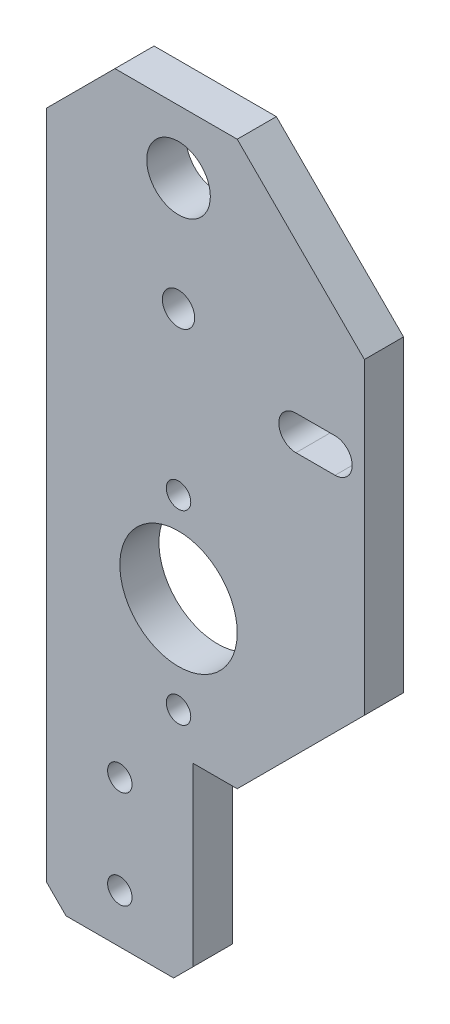
ISO-10303-21;
HEADER;
FILE_DESCRIPTION(('STEP AP214'),'2;1');
FILE_NAME('part.step','',(''),(''),'','','');
FILE_SCHEMA(('AUTOMOTIVE_DESIGN { 1 0 10303 214 1 1 1 1 }'));
ENDSEC;
DATA;
#1=APPLICATION_CONTEXT('core data for automotive mechanical design processes');
#2=APPLICATION_PROTOCOL_DEFINITION('international standard','automotive_design',2000,#1);
#3=PRODUCT_CONTEXT('',#1,'mechanical');
#4=PRODUCT('Part','Part','',(#3));
#5=PRODUCT_RELATED_PRODUCT_CATEGORY('part','',(#4));
#6=PRODUCT_DEFINITION_FORMATION('','',#4);
#7=PRODUCT_DEFINITION_CONTEXT('part definition',#1,'design');
#8=PRODUCT_DEFINITION('design','',#6,#7);
#9=PRODUCT_DEFINITION_SHAPE('','',#8);
#10=(LENGTH_UNIT() NAMED_UNIT(*) SI_UNIT(.MILLI.,.METRE.));
#11=(NAMED_UNIT(*) PLANE_ANGLE_UNIT() SI_UNIT($,.RADIAN.));
#12=(NAMED_UNIT(*) SI_UNIT($,.STERADIAN.) SOLID_ANGLE_UNIT());
#13=UNCERTAINTY_MEASURE_WITH_UNIT(LENGTH_MEASURE(1.E-05),#10,'distance_accuracy_value','');
#14=(GEOMETRIC_REPRESENTATION_CONTEXT(3) GLOBAL_UNCERTAINTY_ASSIGNED_CONTEXT((#13)) GLOBAL_UNIT_ASSIGNED_CONTEXT((#10,
#11,#12)) REPRESENTATION_CONTEXT('',''));
#15=CARTESIAN_POINT('',(0.,0.,0.));
#16=DIRECTION('',(0.,0.,1.));
#17=DIRECTION('',(1.,0.,0.));
#18=AXIS2_PLACEMENT_3D('',#15,#16,#17);
#19=CARTESIAN_POINT('',(0.,0.,4.));
#20=DIRECTION('',(0.,0.,1.));
#21=DIRECTION('',(1.,0.,0.));
#22=AXIS2_PLACEMENT_3D('',#19,#20,#21);
#23=PLANE('',#22);
#24=CARTESIAN_POINT('',(-8.63157894736842,-1.39473684210528,4.));
#25=DIRECTION('',(0.,0.,1.));
#26=DIRECTION('',(1.,0.,0.));
#27=AXIS2_PLACEMENT_3D('',#24,#25,#26);
#28=CIRCLE('',#27,1.25);
#29=CARTESIAN_POINT('',(-7.38157894736842,-1.39473684210528,4.));
#30=VERTEX_POINT('',#29);
#31=EDGE_CURVE('E397',#30,#30,#28,.T.);
#32=ORIENTED_EDGE('',*,*,#31,.F.);
#33=EDGE_LOOP('',(#32));
#34=FACE_BOUND('',#33,.T.);
#35=CARTESIAN_POINT('',(-8.63157894736842,-20.3947368421053,4.));
#36=DIRECTION('',(0.,0.,1.));
#37=DIRECTION('',(1.,0.,0.));
#38=AXIS2_PLACEMENT_3D('',#35,#36,#37);
#39=CIRCLE('',#38,1.25);
#40=CARTESIAN_POINT('',(-7.38157894736842,-20.3947368421053,4.));
#41=VERTEX_POINT('',#40);
#42=EDGE_CURVE('E401',#41,#41,#39,.T.);
#43=ORIENTED_EDGE('',*,*,#42,.F.);
#44=EDGE_LOOP('',(#43));
#45=FACE_BOUND('',#44,.T.);
#46=CARTESIAN_POINT('',(-14.6315789473684,-29.3947368421053,4.));
#47=DIRECTION('',(0.,0.,1.));
#48=DIRECTION('',(1.,0.,0.));
#49=AXIS2_PLACEMENT_3D('',#46,#47,#48);
#50=CIRCLE('',#49,1.25);
#51=CARTESIAN_POINT('',(-13.3815789473684,-29.3947368421053,4.));
#52=VERTEX_POINT('',#51);
#53=EDGE_CURVE('E407',#52,#52,#50,.T.);
#54=ORIENTED_EDGE('',*,*,#53,.F.);
#55=EDGE_LOOP('',(#54));
#56=FACE_BOUND('',#55,.T.);
#57=CARTESIAN_POINT('',(-14.6315789473684,-39.3947368421053,4.));
#58=DIRECTION('',(0.,0.,1.));
#59=DIRECTION('',(1.,0.,0.));
#60=AXIS2_PLACEMENT_3D('',#57,#58,#59);
#61=CIRCLE('',#60,1.25);
#62=CARTESIAN_POINT('',(-13.3815789473684,-39.3947368421053,4.));
#63=VERTEX_POINT('',#62);
#64=EDGE_CURVE('E413',#63,#63,#61,.T.);
#65=ORIENTED_EDGE('',*,*,#64,.F.);
#66=EDGE_LOOP('',(#65));
#67=FACE_BOUND('',#66,.T.);
#68=CARTESIAN_POINT('',(-8.63157894736842,15.1052631578947,4.));
#69=DIRECTION('',(0.,0.,1.));
#70=DIRECTION('',(1.,0.,0.));
#71=AXIS2_PLACEMENT_3D('',#68,#69,#70);
#72=CIRCLE('',#71,1.65);
#73=CARTESIAN_POINT('',(-6.98157894736842,15.1052631578947,4.));
#74=VERTEX_POINT('',#73);
#75=EDGE_CURVE('E419',#74,#74,#72,.T.);
#76=ORIENTED_EDGE('',*,*,#75,.F.);
#77=EDGE_LOOP('',(#76));
#78=FACE_BOUND('',#77,.T.);
#79=CARTESIAN_POINT('',(-8.63157894736842,-10.5789473684211,4.));
#80=DIRECTION('',(0.,0.,1.));
#81=DIRECTION('',(1.,0.,0.));
#82=AXIS2_PLACEMENT_3D('',#79,#80,#81);
#83=CIRCLE('',#82,6.);
#84=CARTESIAN_POINT('',(-2.63157894736842,-10.5789473684211,4.));
#85=VERTEX_POINT('',#84);
#86=EDGE_CURVE('E195',#85,#85,#83,.T.);
#87=ORIENTED_EDGE('',*,*,#86,.F.);
#88=EDGE_LOOP('',(#87));
#89=FACE_BOUND('',#88,.T.);
#90=DIRECTION('',(1.,0.,0.));
#91=VECTOR('',#90,1.);
#92=CARTESIAN_POINT('',(-22.1315789473684,-44.3947368421053,4.));
#93=LINE('',#92,#91);
#94=CARTESIAN_POINT('',(-20.1315789473684,-44.3947368421053,4.));
#95=VERTEX_POINT('',#94);
#96=CARTESIAN_POINT('',(-9.13157894736841,-44.3947368421053,4.));
#97=VERTEX_POINT('',#96);
#98=EDGE_CURVE('E203',#95,#97,#93,.T.);
#99=ORIENTED_EDGE('',*,*,#98,.T.);
#100=DIRECTION('',(-0.707106781186548,-0.707106781186548,0.));
#101=VECTOR('',#100,1.);
#102=CARTESIAN_POINT('',(17.6315789473684,-17.6315789473684,4.));
#103=LINE('',#102,#101);
#104=CARTESIAN_POINT('',(-7.13157894736841,-42.3947368421053,4.));
#105=VERTEX_POINT('',#104);
#106=EDGE_CURVE('E44',#97,#105,#103,.F.);
#107=ORIENTED_EDGE('',*,*,#106,.T.);
#108=DIRECTION('',(0.,1.,0.));
#109=VECTOR('',#108,1.);
#110=CARTESIAN_POINT('',(-7.13157894736841,-24.3947368421053,4.));
#111=LINE('',#110,#109);
#112=CARTESIAN_POINT('',(-7.13157894736841,-24.3947368421053,4.));
#113=VERTEX_POINT('',#112);
#114=EDGE_CURVE('E206',#105,#113,#111,.T.);
#115=ORIENTED_EDGE('',*,*,#114,.T.);
#116=DIRECTION('',(1.,0.,0.));
#117=VECTOR('',#116,1.);
#118=CARTESIAN_POINT('',(-7.13157894736841,-24.3947368421053,4.));
#119=LINE('',#118,#117);
#120=CARTESIAN_POINT('',(-2.63157894736846,-24.3947368421053,4.));
#121=VERTEX_POINT('',#120);
#122=EDGE_CURVE('E208',#113,#121,#119,.T.);
#123=ORIENTED_EDGE('',*,*,#122,.T.);
#124=DIRECTION('',(-0.707106781186549,-0.707106781186546,0.));
#125=VECTOR('',#124,1.);
#126=CARTESIAN_POINT('',(10.8815789473684,-10.8815789473685,4.));
#127=LINE('',#126,#125);
#128=CARTESIAN_POINT('',(10.3684210526316,-11.3947368421053,4.));
#129=VERTEX_POINT('',#128);
#130=EDGE_CURVE('E255',#121,#129,#127,.F.);
#131=ORIENTED_EDGE('',*,*,#130,.T.);
#132=DIRECTION('',(0.,1.,0.));
#133=VECTOR('',#132,1.);
#134=CARTESIAN_POINT('',(10.3684210526316,33.1052631578947,4.));
#135=LINE('',#134,#133);
#136=CARTESIAN_POINT('',(10.3684210526316,20.1052631578947,4.));
#137=VERTEX_POINT('',#136);
#138=EDGE_CURVE('E211',#129,#137,#135,.T.);
#139=ORIENTED_EDGE('',*,*,#138,.T.);
#140=DIRECTION('',(0.707106781186546,-0.707106781186549,0.));
#141=VECTOR('',#140,1.);
#142=CARTESIAN_POINT('',(15.2368421052632,15.2368421052631,4.));
#143=LINE('',#142,#141);
#144=CARTESIAN_POINT('',(-2.6315789473684,33.1052631578947,4.));
#145=VERTEX_POINT('',#144);
#146=EDGE_CURVE('E253',#137,#145,#143,.F.);
#147=ORIENTED_EDGE('',*,*,#146,.T.);
#148=DIRECTION('',(-1.,0.,0.));
#149=VECTOR('',#148,1.);
#150=CARTESIAN_POINT('',(-22.1315789473684,33.1052631578947,4.));
#151=LINE('',#150,#149);
#152=CARTESIAN_POINT('',(-15.1315789473684,33.1052631578947,4.));
#153=VERTEX_POINT('',#152);
#154=EDGE_CURVE('E214',#145,#153,#151,.T.);
#155=ORIENTED_EDGE('',*,*,#154,.T.);
#156=DIRECTION('',(0.707106781186549,0.707106781186546,0.));
#157=VECTOR('',#156,1.);
#158=CARTESIAN_POINT('',(-24.1184210526315,24.1184210526316,4.));
#159=LINE('',#158,#157);
#160=CARTESIAN_POINT('',(-22.1315789473684,26.1052631578947,4.));
#161=VERTEX_POINT('',#160);
#162=EDGE_CURVE('E240',#153,#161,#159,.F.);
#163=ORIENTED_EDGE('',*,*,#162,.T.);
#164=DIRECTION('',(0.,-1.,0.));
#165=VECTOR('',#164,1.);
#166=CARTESIAN_POINT('',(-22.1315789473684,33.1052631578947,4.));
#167=LINE('',#166,#165);
#168=CARTESIAN_POINT('',(-22.1315789473684,-42.3947368421053,4.));
#169=VERTEX_POINT('',#168);
#170=EDGE_CURVE('E201',#161,#169,#167,.T.);
#171=ORIENTED_EDGE('',*,*,#170,.T.);
#172=DIRECTION('',(-0.707106781186546,0.707106781186549,0.));
#173=VECTOR('',#172,1.);
#174=CARTESIAN_POINT('',(-32.2631578947369,-32.2631578947368,4.));
#175=LINE('',#174,#173);
#176=EDGE_CURVE('E271',#169,#95,#175,.F.);
#177=ORIENTED_EDGE('',*,*,#176,.T.);
#178=EDGE_LOOP('',(#99,#107,#115,#123,#131,#139,#147,#155,#163,#171,#177));
#179=FACE_BOUND('',#178,.T.);
#180=CARTESIAN_POINT('',(-8.63157894736842,26.6578947368421,4.));
#181=DIRECTION('',(0.,0.,1.));
#182=DIRECTION('',(1.,0.,0.));
#183=AXIS2_PLACEMENT_3D('',#180,#181,#182);
#184=CIRCLE('',#183,3.25);
#185=CARTESIAN_POINT('',(-5.38157894736842,26.6578947368421,4.));
#186=VERTEX_POINT('',#185);
#187=EDGE_CURVE('E189',#186,#186,#184,.T.);
#188=ORIENTED_EDGE('',*,*,#187,.F.);
#189=EDGE_LOOP('',(#188));
#190=FACE_BOUND('',#189,.T.);
#191=DIRECTION('',(1.,0.,0.));
#192=VECTOR('',#191,1.);
#193=CARTESIAN_POINT('',(3.36842105263158,8.35526315789474,4.));
#194=LINE('',#193,#192);
#195=CARTESIAN_POINT('',(3.36842105263158,8.35526315789474,4.));
#196=VERTEX_POINT('',#195);
#197=CARTESIAN_POINT('',(7.36842105263158,8.35526315789474,4.));
#198=VERTEX_POINT('',#197);
#199=EDGE_CURVE('E156',#196,#198,#194,.T.);
#200=ORIENTED_EDGE('',*,*,#199,.F.);
#201=CARTESIAN_POINT('',(3.36842105263158,10.1052631578947,4.));
#202=DIRECTION('',(0.,0.,1.));
#203=DIRECTION('',(1.,0.,0.));
#204=AXIS2_PLACEMENT_3D('',#201,#202,#203);
#205=CIRCLE('',#204,1.75);
#206=CARTESIAN_POINT('',(3.36842105263158,11.8552631578947,4.));
#207=VERTEX_POINT('',#206);
#208=EDGE_CURVE('E146',#207,#196,#205,.T.);
#209=ORIENTED_EDGE('',*,*,#208,.F.);
#210=DIRECTION('',(-1.,0.,0.));
#211=VECTOR('',#210,1.);
#212=CARTESIAN_POINT('',(3.36842105263158,11.8552631578947,4.));
#213=LINE('',#212,#211);
#214=CARTESIAN_POINT('',(7.36842105263158,11.8552631578947,4.));
#215=VERTEX_POINT('',#214);
#216=EDGE_CURVE('E171',#215,#207,#213,.T.);
#217=ORIENTED_EDGE('',*,*,#216,.F.);
#218=CARTESIAN_POINT('',(7.36842105263158,10.1052631578947,4.));
#219=DIRECTION('',(0.,0.,1.));
#220=DIRECTION('',(1.,0.,0.));
#221=AXIS2_PLACEMENT_3D('',#218,#219,#220);
#222=CIRCLE('',#221,1.75);
#223=EDGE_CURVE('E169',#198,#215,#222,.T.);
#224=ORIENTED_EDGE('',*,*,#223,.F.);
#225=EDGE_LOOP('',(#200,#209,#217,#224));
#226=FACE_BOUND('',#225,.T.);
#227=ADVANCED_FACE('F35',(#34,#45,#56,#67,#78,#89,#179,#190,#226),#23,.T.);
#228=CARTESIAN_POINT('',(0.,0.,0.));
#229=DIRECTION('',(0.,0.,1.));
#230=DIRECTION('',(1.,0.,0.));
#231=AXIS2_PLACEMENT_3D('',#228,#229,#230);
#232=PLANE('',#231);
#233=CARTESIAN_POINT('',(-8.63157894736842,-1.39473684210528,0.));
#234=DIRECTION('',(0.,0.,1.));
#235=DIRECTION('',(1.,0.,0.));
#236=AXIS2_PLACEMENT_3D('',#233,#234,#235);
#237=CIRCLE('',#236,1.25);
#238=CARTESIAN_POINT('',(-7.38157894736842,-1.39473684210528,0.));
#239=VERTEX_POINT('',#238);
#240=EDGE_CURVE('E400',#239,#239,#237,.T.);
#241=ORIENTED_EDGE('',*,*,#240,.T.);
#242=EDGE_LOOP('',(#241));
#243=FACE_BOUND('',#242,.T.);
#244=CARTESIAN_POINT('',(-8.63157894736842,-20.3947368421053,0.));
#245=DIRECTION('',(0.,0.,1.));
#246=DIRECTION('',(1.,0.,0.));
#247=AXIS2_PLACEMENT_3D('',#244,#245,#246);
#248=CIRCLE('',#247,1.25);
#249=CARTESIAN_POINT('',(-7.38157894736842,-20.3947368421053,0.));
#250=VERTEX_POINT('',#249);
#251=EDGE_CURVE('E39',#250,#250,#248,.T.);
#252=ORIENTED_EDGE('',*,*,#251,.T.);
#253=EDGE_LOOP('',(#252));
#254=FACE_BOUND('',#253,.T.);
#255=CARTESIAN_POINT('',(-14.6315789473684,-29.3947368421053,0.));
#256=DIRECTION('',(0.,0.,1.));
#257=DIRECTION('',(1.,0.,0.));
#258=AXIS2_PLACEMENT_3D('',#255,#256,#257);
#259=CIRCLE('',#258,1.25);
#260=CARTESIAN_POINT('',(-13.3815789473684,-29.3947368421053,0.));
#261=VERTEX_POINT('',#260);
#262=EDGE_CURVE('E410',#261,#261,#259,.T.);
#263=ORIENTED_EDGE('',*,*,#262,.T.);
#264=EDGE_LOOP('',(#263));
#265=FACE_BOUND('',#264,.T.);
#266=CARTESIAN_POINT('',(-14.6315789473684,-39.3947368421053,0.));
#267=DIRECTION('',(0.,0.,1.));
#268=DIRECTION('',(1.,0.,0.));
#269=AXIS2_PLACEMENT_3D('',#266,#267,#268);
#270=CIRCLE('',#269,1.25);
#271=CARTESIAN_POINT('',(-13.3815789473684,-39.3947368421053,0.));
#272=VERTEX_POINT('',#271);
#273=EDGE_CURVE('E416',#272,#272,#270,.T.);
#274=ORIENTED_EDGE('',*,*,#273,.T.);
#275=EDGE_LOOP('',(#274));
#276=FACE_BOUND('',#275,.T.);
#277=CARTESIAN_POINT('',(-8.63157894736842,15.1052631578947,0.));
#278=DIRECTION('',(0.,0.,1.));
#279=DIRECTION('',(1.,0.,0.));
#280=AXIS2_PLACEMENT_3D('',#277,#278,#279);
#281=CIRCLE('',#280,1.65);
#282=CARTESIAN_POINT('',(-6.98157894736842,15.1052631578947,0.));
#283=VERTEX_POINT('',#282);
#284=EDGE_CURVE('E178',#283,#283,#281,.T.);
#285=ORIENTED_EDGE('',*,*,#284,.T.);
#286=EDGE_LOOP('',(#285));
#287=FACE_BOUND('',#286,.T.);
#288=CARTESIAN_POINT('',(-8.63157894736842,26.6578947368421,0.));
#289=DIRECTION('',(0.,0.,1.));
#290=DIRECTION('',(1.,0.,0.));
#291=AXIS2_PLACEMENT_3D('',#288,#289,#290);
#292=CIRCLE('',#291,3.25);
#293=CARTESIAN_POINT('',(-5.38157894736842,26.6578947368421,0.));
#294=VERTEX_POINT('',#293);
#295=EDGE_CURVE('E164',#294,#294,#292,.T.);
#296=ORIENTED_EDGE('',*,*,#295,.T.);
#297=EDGE_LOOP('',(#296));
#298=FACE_BOUND('',#297,.T.);
#299=CARTESIAN_POINT('',(-8.63157894736842,-10.5789473684211,0.));
#300=DIRECTION('',(0.,0.,1.));
#301=DIRECTION('',(1.,0.,0.));
#302=AXIS2_PLACEMENT_3D('',#299,#300,#301);
#303=CIRCLE('',#302,6.);
#304=CARTESIAN_POINT('',(-2.63157894736842,-10.5789473684211,0.));
#305=VERTEX_POINT('',#304);
#306=EDGE_CURVE('E192',#305,#305,#303,.T.);
#307=ORIENTED_EDGE('',*,*,#306,.T.);
#308=EDGE_LOOP('',(#307));
#309=FACE_BOUND('',#308,.T.);
#310=DIRECTION('',(0.,1.,0.));
#311=VECTOR('',#310,1.);
#312=CARTESIAN_POINT('',(-7.13157894736841,-24.3947368421053,0.));
#313=LINE('',#312,#311);
#314=CARTESIAN_POINT('',(-7.13157894736841,-42.3947368421053,0.));
#315=VERTEX_POINT('',#314);
#316=CARTESIAN_POINT('',(-7.13157894736841,-24.3947368421053,0.));
#317=VERTEX_POINT('',#316);
#318=EDGE_CURVE('E220',#315,#317,#313,.T.);
#319=ORIENTED_EDGE('',*,*,#318,.F.);
#320=DIRECTION('',(0.707106781186548,0.707106781186548,0.));
#321=VECTOR('',#320,1.);
#322=CARTESIAN_POINT('',(-7.13157894736841,-42.3947368421053,0.));
#323=LINE('',#322,#321);
#324=CARTESIAN_POINT('',(-9.13157894736841,-44.3947368421053,0.));
#325=VERTEX_POINT('',#324);
#326=EDGE_CURVE('E265',#315,#325,#323,.F.);
#327=ORIENTED_EDGE('',*,*,#326,.T.);
#328=DIRECTION('',(1.,0.,0.));
#329=VECTOR('',#328,1.);
#330=CARTESIAN_POINT('',(-22.1315789473684,-44.3947368421053,0.));
#331=LINE('',#330,#329);
#332=CARTESIAN_POINT('',(-20.1315789473684,-44.3947368421053,0.));
#333=VERTEX_POINT('',#332);
#334=EDGE_CURVE('E218',#333,#325,#331,.T.);
#335=ORIENTED_EDGE('',*,*,#334,.F.);
#336=DIRECTION('',(0.707106781186546,-0.707106781186549,0.));
#337=VECTOR('',#336,1.);
#338=CARTESIAN_POINT('',(-20.1315789473684,-44.3947368421053,0.));
#339=LINE('',#338,#337);
#340=CARTESIAN_POINT('',(-22.1315789473684,-42.3947368421053,0.));
#341=VERTEX_POINT('',#340);
#342=EDGE_CURVE('E263',#333,#341,#339,.F.);
#343=ORIENTED_EDGE('',*,*,#342,.T.);
#344=DIRECTION('',(0.,-1.,0.));
#345=VECTOR('',#344,1.);
#346=CARTESIAN_POINT('',(-22.1315789473684,33.1052631578947,0.));
#347=LINE('',#346,#345);
#348=CARTESIAN_POINT('',(-22.1315789473684,26.1052631578947,0.));
#349=VERTEX_POINT('',#348);
#350=EDGE_CURVE('E198',#349,#341,#347,.T.);
#351=ORIENTED_EDGE('',*,*,#350,.F.);
#352=DIRECTION('',(-0.707106781186549,-0.707106781186546,0.));
#353=VECTOR('',#352,1.);
#354=CARTESIAN_POINT('',(-22.1315789473684,26.1052631578947,0.));
#355=LINE('',#354,#353);
#356=CARTESIAN_POINT('',(-15.1315789473684,33.1052631578947,0.));
#357=VERTEX_POINT('',#356);
#358=EDGE_CURVE('E234',#349,#357,#355,.F.);
#359=ORIENTED_EDGE('',*,*,#358,.T.);
#360=DIRECTION('',(-1.,0.,0.));
#361=VECTOR('',#360,1.);
#362=CARTESIAN_POINT('',(-22.1315789473684,33.1052631578947,0.));
#363=LINE('',#362,#361);
#364=CARTESIAN_POINT('',(-2.6315789473684,33.1052631578947,0.));
#365=VERTEX_POINT('',#364);
#366=EDGE_CURVE('E204',#365,#357,#363,.T.);
#367=ORIENTED_EDGE('',*,*,#366,.F.);
#368=DIRECTION('',(-0.707106781186546,0.707106781186549,0.));
#369=VECTOR('',#368,1.);
#370=CARTESIAN_POINT('',(-2.63157894736841,33.1052631578947,0.));
#371=LINE('',#370,#369);
#372=CARTESIAN_POINT('',(10.3684210526316,20.1052631578947,0.));
#373=VERTEX_POINT('',#372);
#374=EDGE_CURVE('E247',#365,#373,#371,.F.);
#375=ORIENTED_EDGE('',*,*,#374,.T.);
#376=DIRECTION('',(0.,1.,0.));
#377=VECTOR('',#376,1.);
#378=CARTESIAN_POINT('',(10.3684210526316,33.1052631578947,0.));
#379=LINE('',#378,#377);
#380=CARTESIAN_POINT('',(10.3684210526316,-11.3947368421053,0.));
#381=VERTEX_POINT('',#380);
#382=EDGE_CURVE('E225',#381,#373,#379,.T.);
#383=ORIENTED_EDGE('',*,*,#382,.F.);
#384=DIRECTION('',(0.707106781186549,0.707106781186546,0.));
#385=VECTOR('',#384,1.);
#386=CARTESIAN_POINT('',(10.3684210526316,-11.3947368421053,0.));
#387=LINE('',#386,#385);
#388=CARTESIAN_POINT('',(-2.63157894736846,-24.3947368421053,0.));
#389=VERTEX_POINT('',#388);
#390=EDGE_CURVE('E249',#381,#389,#387,.F.);
#391=ORIENTED_EDGE('',*,*,#390,.T.);
#392=DIRECTION('',(1.,0.,0.));
#393=VECTOR('',#392,1.);
#394=CARTESIAN_POINT('',(-7.13157894736841,-24.3947368421053,0.));
#395=LINE('',#394,#393);
#396=EDGE_CURVE('E222',#317,#389,#395,.T.);
#397=ORIENTED_EDGE('',*,*,#396,.F.);
#398=EDGE_LOOP('',(#319,#327,#335,#343,#351,#359,#367,#375,#383,#391,#397));
#399=FACE_BOUND('',#398,.T.);
#400=CARTESIAN_POINT('',(3.36842105263158,10.1052631578947,0.));
#401=DIRECTION('',(0.,0.,1.));
#402=DIRECTION('',(1.,0.,0.));
#403=AXIS2_PLACEMENT_3D('',#400,#401,#402);
#404=CIRCLE('',#403,1.75);
#405=CARTESIAN_POINT('',(3.36842105263158,11.8552631578947,0.));
#406=VERTEX_POINT('',#405);
#407=CARTESIAN_POINT('',(3.36842105263158,8.35526315789474,0.));
#408=VERTEX_POINT('',#407);
#409=EDGE_CURVE('E176',#406,#408,#404,.T.);
#410=ORIENTED_EDGE('',*,*,#409,.T.);
#411=DIRECTION('',(1.,0.,0.));
#412=VECTOR('',#411,1.);
#413=CARTESIAN_POINT('',(3.36842105263158,8.35526315789474,0.));
#414=LINE('',#413,#412);
#415=CARTESIAN_POINT('',(7.36842105263158,8.35526315789474,0.));
#416=VERTEX_POINT('',#415);
#417=EDGE_CURVE('E163',#408,#416,#414,.T.);
#418=ORIENTED_EDGE('',*,*,#417,.T.);
#419=CARTESIAN_POINT('',(7.36842105263158,10.1052631578947,0.));
#420=DIRECTION('',(0.,0.,1.));
#421=DIRECTION('',(1.,0.,0.));
#422=AXIS2_PLACEMENT_3D('',#419,#420,#421);
#423=CIRCLE('',#422,1.75);
#424=CARTESIAN_POINT('',(7.36842105263158,11.8552631578947,0.));
#425=VERTEX_POINT('',#424);
#426=EDGE_CURVE('E180',#416,#425,#423,.T.);
#427=ORIENTED_EDGE('',*,*,#426,.T.);
#428=DIRECTION('',(-1.,0.,0.));
#429=VECTOR('',#428,1.);
#430=CARTESIAN_POINT('',(3.36842105263158,11.8552631578947,0.));
#431=LINE('',#430,#429);
#432=EDGE_CURVE('E157',#425,#406,#431,.T.);
#433=ORIENTED_EDGE('',*,*,#432,.T.);
#434=EDGE_LOOP('',(#410,#418,#427,#433));
#435=FACE_BOUND('',#434,.T.);
#436=ADVANCED_FACE('F287',(#243,#254,#265,#276,#287,#298,#309,#399,#435),#232,.F.);
#437=CARTESIAN_POINT('',(-22.1315789473684,33.1052631578947,4.));
#438=DIRECTION('',(1.,0.,0.));
#439=DIRECTION('',(0.,1.,0.));
#440=AXIS2_PLACEMENT_3D('',#437,#438,#439);
#441=PLANE('',#440);
#442=ORIENTED_EDGE('',*,*,#350,.T.);
#443=DIRECTION('',(0.,0.,1.));
#444=VECTOR('',#443,1.);
#445=CARTESIAN_POINT('',(-22.1315789473684,-42.3947368421053,4.));
#446=LINE('',#445,#444);
#447=EDGE_CURVE('E11',#341,#169,#446,.T.);
#448=ORIENTED_EDGE('',*,*,#447,.T.);
#449=ORIENTED_EDGE('',*,*,#170,.F.);
#450=DIRECTION('',(0.,0.,-1.));
#451=VECTOR('',#450,1.);
#452=CARTESIAN_POINT('',(-22.1315789473684,26.1052631578947,4.));
#453=LINE('',#452,#451);
#454=EDGE_CURVE('E231',#161,#349,#453,.T.);
#455=ORIENTED_EDGE('',*,*,#454,.T.);
#456=EDGE_LOOP('',(#442,#448,#449,#455));
#457=FACE_BOUND('',#456,.T.);
#458=ADVANCED_FACE('F295',(#457),#441,.F.);
#459=CARTESIAN_POINT('',(-22.1315789473684,-44.3947368421053,4.));
#460=DIRECTION('',(0.,1.,0.));
#461=DIRECTION('',(-1.,0.,0.));
#462=AXIS2_PLACEMENT_3D('',#459,#460,#461);
#463=PLANE('',#462);
#464=ORIENTED_EDGE('',*,*,#334,.T.);
#465=DIRECTION('',(0.,0.,1.));
#466=VECTOR('',#465,1.);
#467=CARTESIAN_POINT('',(-9.13157894736841,-44.3947368421053,4.));
#468=LINE('',#467,#466);
#469=EDGE_CURVE('E57',#325,#97,#468,.T.);
#470=ORIENTED_EDGE('',*,*,#469,.T.);
#471=ORIENTED_EDGE('',*,*,#98,.F.);
#472=DIRECTION('',(0.,0.,-1.));
#473=VECTOR('',#472,1.);
#474=CARTESIAN_POINT('',(-20.1315789473684,-44.3947368421053,4.));
#475=LINE('',#474,#473);
#476=EDGE_CURVE('E267',#95,#333,#475,.T.);
#477=ORIENTED_EDGE('',*,*,#476,.T.);
#478=EDGE_LOOP('',(#464,#470,#471,#477));
#479=FACE_BOUND('',#478,.T.);
#480=ADVANCED_FACE('F290',(#479),#463,.F.);
#481=CARTESIAN_POINT('',(-7.13157894736841,-24.3947368421053,4.));
#482=DIRECTION('',(-1.,0.,0.));
#483=DIRECTION('',(0.,-1.,0.));
#484=AXIS2_PLACEMENT_3D('',#481,#482,#483);
#485=PLANE('',#484);
#486=ORIENTED_EDGE('',*,*,#114,.F.);
#487=DIRECTION('',(0.,0.,-1.));
#488=VECTOR('',#487,1.);
#489=CARTESIAN_POINT('',(-7.13157894736841,-42.3947368421053,4.));
#490=LINE('',#489,#488);
#491=EDGE_CURVE('E260',#105,#315,#490,.T.);
#492=ORIENTED_EDGE('',*,*,#491,.T.);
#493=ORIENTED_EDGE('',*,*,#318,.T.);
#494=DIRECTION('',(0.,0.,-1.));
#495=VECTOR('',#494,1.);
#496=CARTESIAN_POINT('',(-7.13157894736841,-24.3947368421053,4.));
#497=LINE('',#496,#495);
#498=EDGE_CURVE('E216',#113,#317,#497,.T.);
#499=ORIENTED_EDGE('',*,*,#498,.F.);
#500=EDGE_LOOP('',(#486,#492,#493,#499));
#501=FACE_BOUND('',#500,.T.);
#502=ADVANCED_FACE('F281',(#501),#485,.F.);
#503=CARTESIAN_POINT('',(-7.13157894736841,-24.3947368421053,4.));
#504=DIRECTION('',(0.,1.,0.));
#505=DIRECTION('',(-1.,0.,0.));
#506=AXIS2_PLACEMENT_3D('',#503,#504,#505);
#507=PLANE('',#506);
#508=ORIENTED_EDGE('',*,*,#396,.T.);
#509=DIRECTION('',(0.,0.,1.));
#510=VECTOR('',#509,1.);
#511=CARTESIAN_POINT('',(-2.63157894736846,-24.3947368421053,4.));
#512=LINE('',#511,#510);
#513=EDGE_CURVE('E251',#389,#121,#512,.T.);
#514=ORIENTED_EDGE('',*,*,#513,.T.);
#515=ORIENTED_EDGE('',*,*,#122,.F.);
#516=ORIENTED_EDGE('',*,*,#498,.T.);
#517=EDGE_LOOP('',(#508,#514,#515,#516));
#518=FACE_BOUND('',#517,.T.);
#519=ADVANCED_FACE('F320',(#518),#507,.F.);
#520=CARTESIAN_POINT('',(10.3684210526316,33.1052631578947,4.));
#521=DIRECTION('',(-1.,0.,0.));
#522=DIRECTION('',(0.,-1.,0.));
#523=AXIS2_PLACEMENT_3D('',#520,#521,#522);
#524=PLANE('',#523);
#525=ORIENTED_EDGE('',*,*,#138,.F.);
#526=DIRECTION('',(0.,0.,-1.));
#527=VECTOR('',#526,1.);
#528=CARTESIAN_POINT('',(10.3684210526316,-11.3947368421053,4.));
#529=LINE('',#528,#527);
#530=EDGE_CURVE('E244',#129,#381,#529,.T.);
#531=ORIENTED_EDGE('',*,*,#530,.T.);
#532=ORIENTED_EDGE('',*,*,#382,.T.);
#533=DIRECTION('',(0.,0.,1.));
#534=VECTOR('',#533,1.);
#535=CARTESIAN_POINT('',(10.3684210526316,20.1052631578947,4.));
#536=LINE('',#535,#534);
#537=EDGE_CURVE('E242',#373,#137,#536,.T.);
#538=ORIENTED_EDGE('',*,*,#537,.T.);
#539=EDGE_LOOP('',(#525,#531,#532,#538));
#540=FACE_BOUND('',#539,.T.);
#541=ADVANCED_FACE('F313',(#540),#524,.F.);
#542=CARTESIAN_POINT('',(-22.1315789473684,33.1052631578947,4.));
#543=DIRECTION('',(0.,-1.,0.));
#544=DIRECTION('',(1.,0.,0.));
#545=AXIS2_PLACEMENT_3D('',#542,#543,#544);
#546=PLANE('',#545);
#547=ORIENTED_EDGE('',*,*,#154,.F.);
#548=DIRECTION('',(0.,0.,-1.));
#549=VECTOR('',#548,1.);
#550=CARTESIAN_POINT('',(-2.6315789473684,33.1052631578947,4.));
#551=LINE('',#550,#549);
#552=EDGE_CURVE('E257',#145,#365,#551,.T.);
#553=ORIENTED_EDGE('',*,*,#552,.T.);
#554=ORIENTED_EDGE('',*,*,#366,.T.);
#555=DIRECTION('',(0.,0.,1.));
#556=VECTOR('',#555,1.);
#557=CARTESIAN_POINT('',(-15.1315789473684,33.1052631578947,4.));
#558=LINE('',#557,#556);
#559=EDGE_CURVE('E237',#357,#153,#558,.T.);
#560=ORIENTED_EDGE('',*,*,#559,.T.);
#561=EDGE_LOOP('',(#547,#553,#554,#560));
#562=FACE_BOUND('',#561,.T.);
#563=ADVANCED_FACE('F305',(#562),#546,.F.);
#564=CARTESIAN_POINT('',(-8.63157894736842,-10.5789473684211,4.));
#565=DIRECTION('',(0.,0.,-1.));
#566=DIRECTION('',(-1.,0.,0.));
#567=AXIS2_PLACEMENT_3D('',#564,#565,#566);
#568=CYLINDRICAL_SURFACE('',#567,6.);
#569=ORIENTED_EDGE('',*,*,#86,.T.);
#570=EDGE_LOOP('',(#569));
#571=FACE_BOUND('',#570,.T.);
#572=ORIENTED_EDGE('',*,*,#306,.F.);
#573=EDGE_LOOP('',(#572));
#574=FACE_BOUND('',#573,.T.);
#575=ADVANCED_FACE('F340',(#571,#574),#568,.F.);
#576=CARTESIAN_POINT('',(-8.63157894736842,26.6578947368421,4.));
#577=DIRECTION('',(0.,0.,-1.));
#578=DIRECTION('',(-1.,0.,0.));
#579=AXIS2_PLACEMENT_3D('',#576,#577,#578);
#580=CYLINDRICAL_SURFACE('',#579,3.25);
#581=ORIENTED_EDGE('',*,*,#187,.T.);
#582=EDGE_LOOP('',(#581));
#583=FACE_BOUND('',#582,.T.);
#584=ORIENTED_EDGE('',*,*,#295,.F.);
#585=EDGE_LOOP('',(#584));
#586=FACE_BOUND('',#585,.T.);
#587=ADVANCED_FACE('F347',(#583,#586),#580,.F.);
#588=CARTESIAN_POINT('',(3.36842105263158,10.1052631578947,4.));
#589=DIRECTION('',(0.,0.,-1.));
#590=DIRECTION('',(-1.,0.,0.));
#591=AXIS2_PLACEMENT_3D('',#588,#589,#590);
#592=CYLINDRICAL_SURFACE('',#591,1.75);
#593=ORIENTED_EDGE('',*,*,#409,.F.);
#594=DIRECTION('',(0.,0.,-1.));
#595=VECTOR('',#594,1.);
#596=CARTESIAN_POINT('',(3.36842105263158,11.8552631578947,4.));
#597=LINE('',#596,#595);
#598=EDGE_CURVE('E152',#207,#406,#597,.T.);
#599=ORIENTED_EDGE('',*,*,#598,.F.);
#600=ORIENTED_EDGE('',*,*,#208,.T.);
#601=DIRECTION('',(0.,0.,-1.));
#602=VECTOR('',#601,1.);
#603=CARTESIAN_POINT('',(3.36842105263158,8.35526315789474,4.));
#604=LINE('',#603,#602);
#605=EDGE_CURVE('E149',#196,#408,#604,.T.);
#606=ORIENTED_EDGE('',*,*,#605,.T.);
#607=EDGE_LOOP('',(#593,#599,#600,#606));
#608=FACE_BOUND('',#607,.T.);
#609=ADVANCED_FACE('F148',(#608),#592,.F.);
#610=CARTESIAN_POINT('',(3.36842105263158,8.35526315789474,4.));
#611=DIRECTION('',(0.,1.,0.));
#612=DIRECTION('',(0.,0.,1.));
#613=AXIS2_PLACEMENT_3D('',#610,#611,#612);
#614=PLANE('',#613);
#615=ORIENTED_EDGE('',*,*,#417,.F.);
#616=ORIENTED_EDGE('',*,*,#605,.F.);
#617=ORIENTED_EDGE('',*,*,#199,.T.);
#618=DIRECTION('',(0.,0.,-1.));
#619=VECTOR('',#618,1.);
#620=CARTESIAN_POINT('',(7.36842105263158,8.35526315789474,4.));
#621=LINE('',#620,#619);
#622=EDGE_CURVE('E165',#198,#416,#621,.T.);
#623=ORIENTED_EDGE('',*,*,#622,.T.);
#624=EDGE_LOOP('',(#615,#616,#617,#623));
#625=FACE_BOUND('',#624,.T.);
#626=ADVANCED_FACE('F160',(#625),#614,.T.);
#627=CARTESIAN_POINT('',(7.36842105263158,10.1052631578947,4.));
#628=DIRECTION('',(0.,0.,-1.));
#629=DIRECTION('',(-1.,0.,0.));
#630=AXIS2_PLACEMENT_3D('',#627,#628,#629);
#631=CYLINDRICAL_SURFACE('',#630,1.75);
#632=ORIENTED_EDGE('',*,*,#426,.F.);
#633=ORIENTED_EDGE('',*,*,#622,.F.);
#634=ORIENTED_EDGE('',*,*,#223,.T.);
#635=DIRECTION('',(0.,0.,-1.));
#636=VECTOR('',#635,1.);
#637=CARTESIAN_POINT('',(7.36842105263158,11.8552631578947,4.));
#638=LINE('',#637,#636);
#639=EDGE_CURVE('E186',#215,#425,#638,.T.);
#640=ORIENTED_EDGE('',*,*,#639,.T.);
#641=EDGE_LOOP('',(#632,#633,#634,#640));
#642=FACE_BOUND('',#641,.T.);
#643=ADVANCED_FACE('F366',(#642),#631,.F.);
#644=CARTESIAN_POINT('',(3.36842105263158,11.8552631578947,4.));
#645=DIRECTION('',(0.,-1.,0.));
#646=DIRECTION('',(0.,0.,-1.));
#647=AXIS2_PLACEMENT_3D('',#644,#645,#646);
#648=PLANE('',#647);
#649=ORIENTED_EDGE('',*,*,#432,.F.);
#650=ORIENTED_EDGE('',*,*,#639,.F.);
#651=ORIENTED_EDGE('',*,*,#216,.T.);
#652=ORIENTED_EDGE('',*,*,#598,.T.);
#653=EDGE_LOOP('',(#649,#650,#651,#652));
#654=FACE_BOUND('',#653,.T.);
#655=ADVANCED_FACE('F369',(#654),#648,.T.);
#656=CARTESIAN_POINT('',(-22.1315789473684,26.1052631578947,4.));
#657=DIRECTION('',(0.707106781186546,-0.707106781186549,0.));
#658=DIRECTION('',(0.,0.,-1.));
#659=AXIS2_PLACEMENT_3D('',#656,#657,#658);
#660=PLANE('',#659);
#661=ORIENTED_EDGE('',*,*,#162,.F.);
#662=ORIENTED_EDGE('',*,*,#559,.F.);
#663=ORIENTED_EDGE('',*,*,#358,.F.);
#664=ORIENTED_EDGE('',*,*,#454,.F.);
#665=EDGE_LOOP('',(#661,#662,#663,#664));
#666=FACE_BOUND('',#665,.T.);
#667=ADVANCED_FACE('F299',(#666),#660,.F.);
#668=CARTESIAN_POINT('',(10.3684210526316,-11.3947368421053,4.));
#669=DIRECTION('',(-0.707106781186546,0.707106781186549,0.));
#670=DIRECTION('',(0.,0.,-1.));
#671=AXIS2_PLACEMENT_3D('',#668,#669,#670);
#672=PLANE('',#671);
#673=ORIENTED_EDGE('',*,*,#130,.F.);
#674=ORIENTED_EDGE('',*,*,#513,.F.);
#675=ORIENTED_EDGE('',*,*,#390,.F.);
#676=ORIENTED_EDGE('',*,*,#530,.F.);
#677=EDGE_LOOP('',(#673,#674,#675,#676));
#678=FACE_BOUND('',#677,.T.);
#679=ADVANCED_FACE('F318',(#678),#672,.F.);
#680=CARTESIAN_POINT('',(-2.63157894736841,33.1052631578947,4.));
#681=DIRECTION('',(-0.707106781186549,-0.707106781186546,0.));
#682=DIRECTION('',(0.,0.,-1.));
#683=AXIS2_PLACEMENT_3D('',#680,#681,#682);
#684=PLANE('',#683);
#685=ORIENTED_EDGE('',*,*,#146,.F.);
#686=ORIENTED_EDGE('',*,*,#537,.F.);
#687=ORIENTED_EDGE('',*,*,#374,.F.);
#688=ORIENTED_EDGE('',*,*,#552,.F.);
#689=EDGE_LOOP('',(#685,#686,#687,#688));
#690=FACE_BOUND('',#689,.T.);
#691=ADVANCED_FACE('F309',(#690),#684,.F.);
#692=CARTESIAN_POINT('',(-7.13157894736841,-42.3947368421053,4.));
#693=DIRECTION('',(-0.707106781186547,0.707106781186547,0.));
#694=DIRECTION('',(0.,0.,-1.));
#695=AXIS2_PLACEMENT_3D('',#692,#693,#694);
#696=PLANE('',#695);
#697=ORIENTED_EDGE('',*,*,#106,.F.);
#698=ORIENTED_EDGE('',*,*,#469,.F.);
#699=ORIENTED_EDGE('',*,*,#326,.F.);
#700=ORIENTED_EDGE('',*,*,#491,.F.);
#701=EDGE_LOOP('',(#697,#698,#699,#700));
#702=FACE_BOUND('',#701,.T.);
#703=ADVANCED_FACE('F284',(#702),#696,.F.);
#704=CARTESIAN_POINT('',(-20.1315789473684,-44.3947368421053,4.));
#705=DIRECTION('',(0.707106781186549,0.707106781186546,0.));
#706=DIRECTION('',(0.,0.,-1.));
#707=AXIS2_PLACEMENT_3D('',#704,#705,#706);
#708=PLANE('',#707);
#709=ORIENTED_EDGE('',*,*,#176,.F.);
#710=ORIENTED_EDGE('',*,*,#447,.F.);
#711=ORIENTED_EDGE('',*,*,#342,.F.);
#712=ORIENTED_EDGE('',*,*,#476,.F.);
#713=EDGE_LOOP('',(#709,#710,#711,#712));
#714=FACE_BOUND('',#713,.T.);
#715=ADVANCED_FACE('F37',(#714),#708,.F.);
#716=CARTESIAN_POINT('',(-8.63157894736842,15.1052631578947,4.));
#717=DIRECTION('',(0.,0.,1.));
#718=DIRECTION('',(1.,0.,0.));
#719=AXIS2_PLACEMENT_3D('',#716,#717,#718);
#720=CYLINDRICAL_SURFACE('',#719,1.65);
#721=ORIENTED_EDGE('',*,*,#75,.T.);
#722=EDGE_LOOP('',(#721));
#723=FACE_BOUND('',#722,.T.);
#724=ORIENTED_EDGE('',*,*,#284,.F.);
#725=EDGE_LOOP('',(#724));
#726=FACE_BOUND('',#725,.T.);
#727=ADVANCED_FACE('F374',(#723,#726),#720,.F.);
#728=CARTESIAN_POINT('',(-14.6315789473684,-39.3947368421053,4.));
#729=DIRECTION('',(0.,0.,1.));
#730=DIRECTION('',(1.,0.,0.));
#731=AXIS2_PLACEMENT_3D('',#728,#729,#730);
#732=CYLINDRICAL_SURFACE('',#731,1.25);
#733=ORIENTED_EDGE('',*,*,#64,.T.);
#734=EDGE_LOOP('',(#733));
#735=FACE_BOUND('',#734,.T.);
#736=ORIENTED_EDGE('',*,*,#273,.F.);
#737=EDGE_LOOP('',(#736));
#738=FACE_BOUND('',#737,.T.);
#739=ADVANCED_FACE('F377',(#735,#738),#732,.F.);
#740=CARTESIAN_POINT('',(-14.6315789473684,-29.3947368421053,4.));
#741=DIRECTION('',(0.,0.,1.));
#742=DIRECTION('',(1.,0.,0.));
#743=AXIS2_PLACEMENT_3D('',#740,#741,#742);
#744=CYLINDRICAL_SURFACE('',#743,1.25);
#745=ORIENTED_EDGE('',*,*,#53,.T.);
#746=EDGE_LOOP('',(#745));
#747=FACE_BOUND('',#746,.T.);
#748=ORIENTED_EDGE('',*,*,#262,.F.);
#749=EDGE_LOOP('',(#748));
#750=FACE_BOUND('',#749,.T.);
#751=ADVANCED_FACE('F381',(#747,#750),#744,.F.);
#752=CARTESIAN_POINT('',(-8.63157894736842,-20.3947368421053,4.));
#753=DIRECTION('',(0.,0.,1.));
#754=DIRECTION('',(1.,0.,0.));
#755=AXIS2_PLACEMENT_3D('',#752,#753,#754);
#756=CYLINDRICAL_SURFACE('',#755,1.25);
#757=ORIENTED_EDGE('',*,*,#42,.T.);
#758=EDGE_LOOP('',(#757));
#759=FACE_BOUND('',#758,.T.);
#760=ORIENTED_EDGE('',*,*,#251,.F.);
#761=EDGE_LOOP('',(#760));
#762=FACE_BOUND('',#761,.T.);
#763=ADVANCED_FACE('F385',(#759,#762),#756,.F.);
#764=CARTESIAN_POINT('',(-8.63157894736842,-1.39473684210528,4.));
#765=DIRECTION('',(0.,0.,1.));
#766=DIRECTION('',(1.,0.,0.));
#767=AXIS2_PLACEMENT_3D('',#764,#765,#766);
#768=CYLINDRICAL_SURFACE('',#767,1.25);
#769=ORIENTED_EDGE('',*,*,#31,.T.);
#770=EDGE_LOOP('',(#769));
#771=FACE_BOUND('',#770,.T.);
#772=ORIENTED_EDGE('',*,*,#240,.F.);
#773=EDGE_LOOP('',(#772));
#774=FACE_BOUND('',#773,.T.);
#775=ADVANCED_FACE('F389',(#771,#774),#768,.F.);
#776=CLOSED_SHELL('',(#227,#436,#458,#480,#502,#519,#541,#563,#575,#587,#609,#626,#643,#655,
#667,#679,#691,#703,#715,#727,#739,#751,#763,#775));
#777=MANIFOLD_SOLID_BREP('B2',#776);
#778=ADVANCED_BREP_SHAPE_REPRESENTATION('',(#18,#777),#14);
#779=SHAPE_DEFINITION_REPRESENTATION(#9,#778);
ENDSEC;
END-ISO-10303-21;
